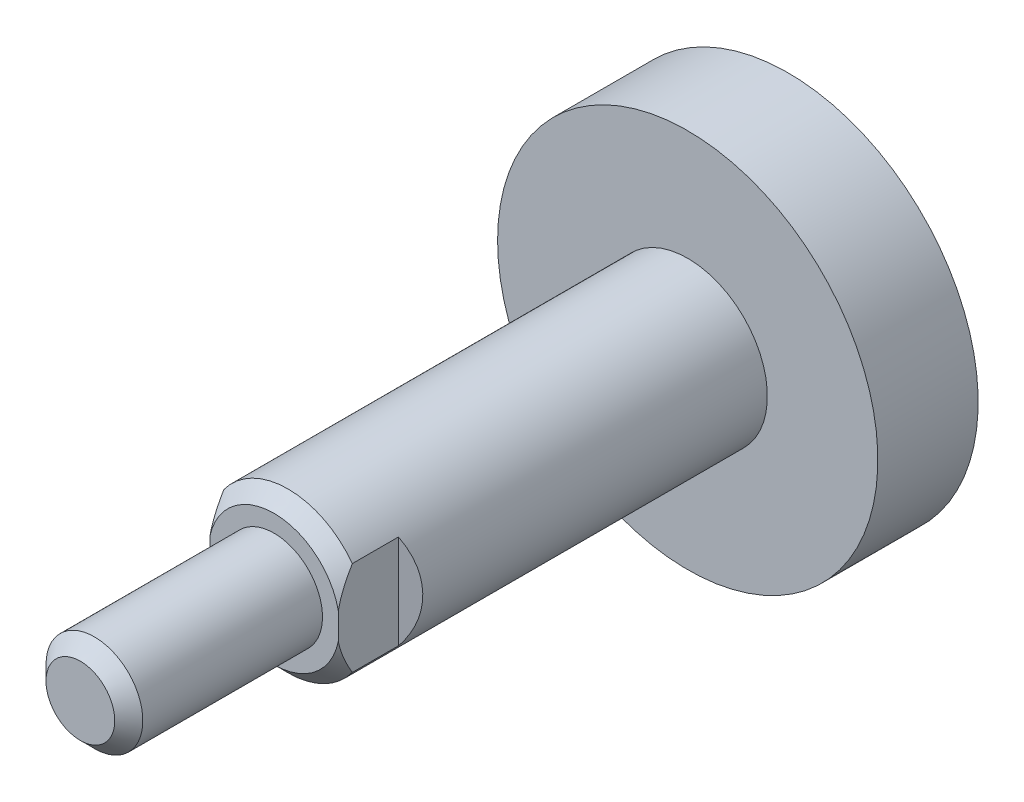
ISO-10303-21;
HEADER;
FILE_DESCRIPTION(('STEP AP214'),'2;1');
FILE_NAME('part.step','',(''),(''),'','','');
FILE_SCHEMA(('AUTOMOTIVE_DESIGN { 1 0 10303 214 1 1 1 1 }'));
ENDSEC;
DATA;
#1=APPLICATION_CONTEXT('core data for automotive mechanical design processes');
#2=APPLICATION_PROTOCOL_DEFINITION('international standard','automotive_design',2000,#1);
#3=PRODUCT_CONTEXT('',#1,'mechanical');
#4=PRODUCT('Part','Part','',(#3));
#5=PRODUCT_RELATED_PRODUCT_CATEGORY('part','',(#4));
#6=PRODUCT_DEFINITION_FORMATION('','',#4);
#7=PRODUCT_DEFINITION_CONTEXT('part definition',#1,'design');
#8=PRODUCT_DEFINITION('design','',#6,#7);
#9=PRODUCT_DEFINITION_SHAPE('','',#8);
#10=(LENGTH_UNIT() NAMED_UNIT(*) SI_UNIT(.MILLI.,.METRE.));
#11=(NAMED_UNIT(*) PLANE_ANGLE_UNIT() SI_UNIT($,.RADIAN.));
#12=(NAMED_UNIT(*) SI_UNIT($,.STERADIAN.) SOLID_ANGLE_UNIT());
#13=UNCERTAINTY_MEASURE_WITH_UNIT(LENGTH_MEASURE(1.E-05),#10,'distance_accuracy_value','');
#14=(GEOMETRIC_REPRESENTATION_CONTEXT(3) GLOBAL_UNCERTAINTY_ASSIGNED_CONTEXT((#13)) GLOBAL_UNIT_ASSIGNED_CONTEXT((#10,
#11,#12)) REPRESENTATION_CONTEXT('',''));
#15=CARTESIAN_POINT('',(0.,0.,0.));
#16=DIRECTION('',(0.,0.,1.));
#17=DIRECTION('',(1.,0.,0.));
#18=AXIS2_PLACEMENT_3D('',#15,#16,#17);
#19=CARTESIAN_POINT('',(0.,0.,35.266));
#20=DIRECTION('',(0.,0.,1.));
#21=DIRECTION('',(1.,0.,0.));
#22=AXIS2_PLACEMENT_3D('',#19,#20,#21);
#23=PLANE('',#22);
#24=CARTESIAN_POINT('',(0.,0.,35.2659999999219));
#25=DIRECTION('',(0.,0.,-1.));
#26=DIRECTION('',(-1.,0.,0.));
#27=AXIS2_PLACEMENT_3D('',#24,#25,#26);
#28=CIRCLE('',#27,1.71299999999519);
#29=CARTESIAN_POINT('',(-1.71299999999519,0.,35.2659999999219));
#30=VERTEX_POINT('',#29);
#31=EDGE_CURVE('E19',#30,#30,#28,.T.);
#32=ORIENTED_EDGE('',*,*,#31,.F.);
#33=EDGE_LOOP('',(#32));
#34=FACE_BOUND('',#33,.T.);
#35=ADVANCED_FACE('F16',(#34),#23,.T.);
#36=CARTESIAN_POINT('',(0.,0.,34.5659999999839));
#37=DIRECTION('',(0.,0.,-1.));
#38=DIRECTION('',(-1.,0.,0.));
#39=AXIS2_PLACEMENT_3D('',#36,#37,#38);
#40=CONICAL_SURFACE('',#39,2.41299999993316,0.785398163397448);
#41=ORIENTED_EDGE('',*,*,#31,.T.);
#42=EDGE_LOOP('',(#41));
#43=FACE_BOUND('',#42,.T.);
#44=CARTESIAN_POINT('',(0.,0.,34.566));
#45=DIRECTION('',(0.,0.,-1.));
#46=DIRECTION('',(-1.,0.,0.));
#47=AXIS2_PLACEMENT_3D('',#44,#45,#46);
#48=CIRCLE('',#47,2.413);
#49=CARTESIAN_POINT('',(-2.413,0.,34.566));
#50=VERTEX_POINT('',#49);
#51=EDGE_CURVE('E71',#50,#50,#48,.T.);
#52=ORIENTED_EDGE('',*,*,#51,.F.);
#53=EDGE_LOOP('',(#52));
#54=FACE_BOUND('',#53,.T.);
#55=ADVANCED_FACE('F196',(#43,#54),#40,.T.);
#56=CARTESIAN_POINT('',(0.,0.,35.266));
#57=DIRECTION('',(0.,0.,-1.));
#58=DIRECTION('',(-1.,0.,0.));
#59=AXIS2_PLACEMENT_3D('',#56,#57,#58);
#60=CYLINDRICAL_SURFACE('',#59,2.413);
#61=ORIENTED_EDGE('',*,*,#51,.T.);
#62=EDGE_LOOP('',(#61));
#63=FACE_BOUND('',#62,.T.);
#64=CARTESIAN_POINT('',(0.,0.,25.614));
#65=DIRECTION('',(0.,0.,-1.));
#66=DIRECTION('',(-1.,0.,0.));
#67=AXIS2_PLACEMENT_3D('',#64,#65,#66);
#68=CIRCLE('',#67,2.413);
#69=CARTESIAN_POINT('',(-2.413,0.,25.614));
#70=VERTEX_POINT('',#69);
#71=EDGE_CURVE('E70',#70,#70,#68,.F.);
#72=ORIENTED_EDGE('',*,*,#71,.T.);
#73=EDGE_LOOP('',(#72));
#74=FACE_BOUND('',#73,.T.);
#75=ADVANCED_FACE('F203',(#63,#74),#60,.T.);
#76=CARTESIAN_POINT('',(0.,0.,25.614));
#77=DIRECTION('',(0.,0.,-1.));
#78=DIRECTION('',(0.,1.,0.));
#79=AXIS2_PLACEMENT_3D('',#76,#77,#78);
#80=PLANE('',#79);
#81=ORIENTED_EDGE('',*,*,#71,.F.);
#82=EDGE_LOOP('',(#81));
#83=FACE_BOUND('',#82,.T.);
#84=DIRECTION('',(0.,1.,0.));
#85=VECTOR('',#84,1.);
#86=CARTESIAN_POINT('',(3.2,0.,25.614));
#87=LINE('',#86,#85);
#88=CARTESIAN_POINT('',(3.2,0.668102537170797,25.6139999999809));
#89=VERTEX_POINT('',#88);
#90=CARTESIAN_POINT('',(3.2,-0.668102537170798,25.6139999999809));
#91=VERTEX_POINT('',#90);
#92=EDGE_CURVE('E58',#89,#91,#87,.F.);
#93=ORIENTED_EDGE('',*,*,#92,.F.);
#94=CARTESIAN_POINT('',(0.,0.,25.6139999999618));
#95=DIRECTION('',(0.,0.,-1.));
#96=DIRECTION('',(0.,1.,0.));
#97=AXIS2_PLACEMENT_3D('',#94,#95,#96);
#98=CIRCLE('',#97,3.26900000004571);
#99=CARTESIAN_POINT('',(-3.2,0.668102537155263,25.6139999999841));
#100=VERTEX_POINT('',#99);
#101=EDGE_CURVE('E91',#100,#89,#98,.T.);
#102=ORIENTED_EDGE('',*,*,#101,.F.);
#103=DIRECTION('',(0.,1.,0.));
#104=VECTOR('',#103,1.);
#105=CARTESIAN_POINT('',(-3.2,-9.475,25.614));
#106=LINE('',#105,#104);
#107=CARTESIAN_POINT('',(-3.2,-0.668102537154732,25.6139999999842));
#108=VERTEX_POINT('',#107);
#109=EDGE_CURVE('E77',#100,#108,#106,.F.);
#110=ORIENTED_EDGE('',*,*,#109,.T.);
#111=CARTESIAN_POINT('',(0.,0.,25.6139999999618));
#112=DIRECTION('',(0.,0.,-1.));
#113=DIRECTION('',(0.,1.,0.));
#114=AXIS2_PLACEMENT_3D('',#111,#112,#113);
#115=CIRCLE('',#114,3.26900000004571);
#116=EDGE_CURVE('E75',#91,#108,#115,.T.);
#117=ORIENTED_EDGE('',*,*,#116,.F.);
#118=EDGE_LOOP('',(#93,#102,#110,#117));
#119=FACE_BOUND('',#118,.T.);
#120=ADVANCED_FACE('F76',(#83,#119),#80,.F.);
#121=CARTESIAN_POINT('',(0.,0.,24.9140000000807));
#122=DIRECTION('',(0.,0.,-1.));
#123=DIRECTION('',(0.,1.,0.));
#124=AXIS2_PLACEMENT_3D('',#121,#122,#123);
#125=CONICAL_SURFACE('',#124,3.96899999998368,0.785398163438051);
#126=CARTESIAN_POINT('',(-3.20000000000324,-0.668102537045559,25.6140000000079));
#127=CARTESIAN_POINT('',(-3.20000000000116,-0.791923989307162,25.5887118948215));
#128=CARTESIAN_POINT('',(-3.20000000000031,-0.914214432197644,25.5569533814339));
#129=CARTESIAN_POINT('',(-3.19999999999969,-1.15522323067472,25.482786734809));
#130=CARTESIAN_POINT('',(-3.19999999999992,-1.27394966585461,25.440405109426));
#131=CARTESIAN_POINT('',(-3.20000000000008,-1.50692397331803,25.3475394481742));
#132=CARTESIAN_POINT('',(-3.20000000000002,-1.62120166838874,25.2971285477279));
#133=CARTESIAN_POINT('',(-3.19999999999998,-1.8466563464418,25.1897204575799));
#134=CARTESIAN_POINT('',(-3.2,-1.95783200288132,25.1327205021669));
#135=CARTESIAN_POINT('',(-3.2,-2.1147772258552,25.047544782855));
#136=CARTESIAN_POINT('',(-3.2,-2.161701362435,25.021462011141));
#137=CARTESIAN_POINT('',(-3.2,-2.25515024754835,24.9683835316909));
#138=CARTESIAN_POINT('',(-3.2,-2.30167405357722,24.9413861634868));
#139=CARTESIAN_POINT('',(-3.2,-2.34796954838271,24.9140000000477));
#140=B_SPLINE_CURVE_WITH_KNOTS('',3,(#126,#127,#128,#129,#130,#131,#132,#133,#134,#135,#136,
#137,#138,#139),.UNSPECIFIED.,.F.,.F.,(4,2,2,2,2,2,4),(0.,0.378663318923574,0.756391005243895,
1.13085654278463,1.50547983437227,1.66653163363144,1.82789340191547),.UNSPECIFIED.);
#141=CARTESIAN_POINT('',(-3.2,-2.3479695483686,24.9140000000238));
#142=VERTEX_POINT('',#141);
#143=EDGE_CURVE('E116',#108,#142,#140,.T.);
#144=ORIENTED_EDGE('',*,*,#143,.T.);
#145=CARTESIAN_POINT('',(0.,0.,24.914));
#146=DIRECTION('',(0.,0.,-1.));
#147=DIRECTION('',(-1.,0.,0.));
#148=AXIS2_PLACEMENT_3D('',#145,#146,#147);
#149=CIRCLE('',#148,3.969);
#150=CARTESIAN_POINT('',(3.2,-2.3479695483686,24.9140000000238));
#151=VERTEX_POINT('',#150);
#152=EDGE_CURVE('E85',#151,#142,#149,.T.);
#153=ORIENTED_EDGE('',*,*,#152,.F.);
#154=CARTESIAN_POINT('',(3.2,-2.34796954838271,24.9140000000477));
#155=CARTESIAN_POINT('',(3.2,-2.28227540638902,24.9528576848915));
#156=CARTESIAN_POINT('',(3.2,-2.21612013329714,24.9909397042438));
#157=CARTESIAN_POINT('',(3.2,-2.08277615458881,25.065293160087));
#158=CARTESIAN_POINT('',(3.2,-2.01558715530726,25.1015640691656));
#159=CARTESIAN_POINT('',(3.2,-1.81330543751406,25.2067462963586));
#160=CARTESIAN_POINT('',(3.2,-1.6765834937986,25.2725768397312));
#161=CARTESIAN_POINT('',(3.2,-1.39788707534561,25.3932563066866));
#162=CARTESIAN_POINT('',(3.2,-1.25590184064602,25.4480810761872));
#163=CARTESIAN_POINT('',(3.2,-0.966123687795267,25.5431571719073));
#164=CARTESIAN_POINT('',(3.2,-0.81829778980787,25.5833066541209));
#165=CARTESIAN_POINT('',(3.2,-0.668102537044839,25.6140000000067));
#166=B_SPLINE_CURVE_WITH_KNOTS('',3,(#154,#155,#156,#157,#158,#159,#160,#161,#162,#163,#164,
#165),.UNSPECIFIED.,.F.,.F.,(4,2,2,2,2,4),(0.,0.228972156487963,0.458010607517393,
0.91289148643811,1.36876002116686,1.82773469580556),.UNSPECIFIED.);
#167=EDGE_CURVE('E63',#151,#91,#166,.T.);
#168=ORIENTED_EDGE('',*,*,#167,.T.);
#169=ORIENTED_EDGE('',*,*,#116,.T.);
#170=EDGE_LOOP('',(#144,#153,#168,#169));
#171=FACE_BOUND('',#170,.T.);
#172=ADVANCED_FACE('F84',(#171),#125,.T.);
#173=CARTESIAN_POINT('',(3.2,-9.475,22.614));
#174=DIRECTION('',(-0.500000000000005,0.,-0.866025403784436));
#175=DIRECTION('',(-0.866025403784436,0.,0.500000000000005));
#176=AXIS2_PLACEMENT_3D('',#173,#174,#175);
#177=PLANE('',#176);
#178=CARTESIAN_POINT('',(0.,0.,24.4615208614068));
#179=DIRECTION('',(-0.500000000000005,0.,-0.866025403784436));
#180=DIRECTION('',(0.866025403784436,0.,-0.500000000000005));
#181=AXIS2_PLACEMENT_3D('',#178,#179,#180);
#182=ELLIPSE('',#181,4.58300643682726,3.969);
#183=CARTESIAN_POINT('',(3.2,2.34796954835449,22.614));
#184=VERTEX_POINT('',#183);
#185=CARTESIAN_POINT('',(3.2,-2.34796954835449,22.614));
#186=VERTEX_POINT('',#185);
#187=EDGE_CURVE('E175',#184,#186,#182,.T.);
#188=ORIENTED_EDGE('',*,*,#187,.F.);
#189=DIRECTION('',(0.,1.,0.));
#190=VECTOR('',#189,1.);
#191=CARTESIAN_POINT('',(3.2,-9.475,22.614));
#192=LINE('',#191,#190);
#193=EDGE_CURVE('E86',#184,#186,#192,.F.);
#194=ORIENTED_EDGE('',*,*,#193,.T.);
#195=EDGE_LOOP('',(#188,#194));
#196=FACE_BOUND('',#195,.T.);
#197=ADVANCED_FACE('F111',(#196),#177,.F.);
#198=CARTESIAN_POINT('',(-3.2,-9.475,22.614));
#199=DIRECTION('',(0.500000000000004,0.,-0.866025403784436));
#200=DIRECTION('',(-0.866025403784436,0.,-0.500000000000004));
#201=AXIS2_PLACEMENT_3D('',#198,#199,#200);
#202=PLANE('',#201);
#203=CARTESIAN_POINT('',(0.,0.,24.4615208614068));
#204=DIRECTION('',(0.500000000000004,0.,-0.866025403784436));
#205=DIRECTION('',(-0.866025403784436,0.,-0.500000000000004));
#206=AXIS2_PLACEMENT_3D('',#203,#204,#205);
#207=ELLIPSE('',#206,4.58300643682726,3.969);
#208=CARTESIAN_POINT('',(-3.2,-2.34796954835449,22.614));
#209=VERTEX_POINT('',#208);
#210=CARTESIAN_POINT('',(-3.2,2.34796954835449,22.614));
#211=VERTEX_POINT('',#210);
#212=EDGE_CURVE('E172',#209,#211,#207,.T.);
#213=ORIENTED_EDGE('',*,*,#212,.F.);
#214=DIRECTION('',(0.,1.,0.));
#215=VECTOR('',#214,1.);
#216=CARTESIAN_POINT('',(-3.2,-9.475,22.614));
#217=LINE('',#216,#215);
#218=EDGE_CURVE('E81',#209,#211,#217,.T.);
#219=ORIENTED_EDGE('',*,*,#218,.T.);
#220=EDGE_LOOP('',(#213,#219));
#221=FACE_BOUND('',#220,.T.);
#222=ADVANCED_FACE('F129',(#221),#202,.F.);
#223=CARTESIAN_POINT('',(-3.2,-9.475,25.614));
#224=DIRECTION('',(1.,0.,0.));
#225=DIRECTION('',(0.,0.,-1.));
#226=AXIS2_PLACEMENT_3D('',#223,#224,#225);
#227=PLANE('',#226);
#228=ORIENTED_EDGE('',*,*,#143,.F.);
#229=ORIENTED_EDGE('',*,*,#109,.F.);
#230=CARTESIAN_POINT('',(-3.19999999998987,2.34796954838807,24.9140000000384));
#231=CARTESIAN_POINT('',(-3.19999999999627,2.28227540639574,24.9528576848853));
#232=CARTESIAN_POINT('',(-3.19999999999898,2.21612013330425,24.9909397042391));
#233=CARTESIAN_POINT('',(-3.20000000000102,2.08277615459583,25.0652931600838));
#234=CARTESIAN_POINT('',(-3.20000000000036,2.01558715531381,25.1015640691624));
#235=CARTESIAN_POINT('',(-3.19999999999929,1.81330543751945,25.2067462963555));
#236=CARTESIAN_POINT('',(-3.1999999999998,1.67658349380355,25.2725768397288));
#237=CARTESIAN_POINT('',(-3.2000000000002,1.39788707534955,25.3932563066852));
#238=CARTESIAN_POINT('',(-3.2000000000001,1.2559018406494,25.4480810761861));
#239=CARTESIAN_POINT('',(-3.1999999999999,0.966123687797418,25.5431571719066));
#240=CARTESIAN_POINT('',(-3.19999999999979,0.818297789809342,25.5833066541205));
#241=CARTESIAN_POINT('',(-3.2,0.668102537045687,25.6140000000065));
#242=B_SPLINE_CURVE_WITH_KNOTS('',3,(#230,#231,#232,#233,#234,#235,#236,#237,#238,#239,#240,
#241),.UNSPECIFIED.,.F.,.F.,(4,2,2,2,2,4),(0.,0.228972156489184,0.458010607519769,
0.912891486442607,1.3687600211732,1.82773469581398),.UNSPECIFIED.);
#243=CARTESIAN_POINT('',(-3.2,2.34796954835449,24.9140000000322));
#244=VERTEX_POINT('',#243);
#245=EDGE_CURVE('E121',#244,#100,#242,.T.);
#246=ORIENTED_EDGE('',*,*,#245,.F.);
#247=DIRECTION('',(0.,0.,-1.));
#248=VECTOR('',#247,1.);
#249=CARTESIAN_POINT('',(-3.2,2.34796954835449,36.8400272581176));
#250=LINE('',#249,#248);
#251=EDGE_CURVE('E174',#211,#244,#250,.F.);
#252=ORIENTED_EDGE('',*,*,#251,.F.);
#253=ORIENTED_EDGE('',*,*,#218,.F.);
#254=DIRECTION('',(0.,0.,-1.));
#255=VECTOR('',#254,1.);
#256=CARTESIAN_POINT('',(-3.2,-2.34796954835449,36.8400272581176));
#257=LINE('',#256,#255);
#258=EDGE_CURVE('E177',#142,#209,#257,.T.);
#259=ORIENTED_EDGE('',*,*,#258,.F.);
#260=EDGE_LOOP('',(#228,#229,#246,#252,#253,#259));
#261=FACE_BOUND('',#260,.T.);
#262=ADVANCED_FACE('F125',(#261),#227,.F.);
#263=CARTESIAN_POINT('',(0.,0.,24.9140000000807));
#264=DIRECTION('',(0.,0.,-1.));
#265=DIRECTION('',(0.,1.,0.));
#266=AXIS2_PLACEMENT_3D('',#263,#264,#265);
#267=CONICAL_SURFACE('',#266,3.96899999998368,0.785398163438051);
#268=ORIENTED_EDGE('',*,*,#245,.T.);
#269=ORIENTED_EDGE('',*,*,#101,.T.);
#270=CARTESIAN_POINT('',(3.20000000000325,0.668102537045564,25.6140000000079));
#271=CARTESIAN_POINT('',(3.20000000000117,0.791923989307168,25.5887118948215));
#272=CARTESIAN_POINT('',(3.20000000000031,0.914214432197651,25.5569533814339));
#273=CARTESIAN_POINT('',(3.19999999999969,1.15522323067473,25.482786734809));
#274=CARTESIAN_POINT('',(3.19999999999992,1.27394966585462,25.440405109426));
#275=CARTESIAN_POINT('',(3.20000000000008,1.50692397331804,25.3475394481742));
#276=CARTESIAN_POINT('',(3.20000000000003,1.62120166838875,25.2971285477279));
#277=CARTESIAN_POINT('',(3.19999999999998,1.84665634644181,25.1897204575799));
#278=CARTESIAN_POINT('',(3.2,1.95783200288133,25.1327205021669));
#279=CARTESIAN_POINT('',(3.20000000000001,2.11477722585521,25.0475447828549));
#280=CARTESIAN_POINT('',(3.2,2.161701362435,25.021462011141));
#281=CARTESIAN_POINT('',(3.2,2.25515024754835,24.9683835316909));
#282=CARTESIAN_POINT('',(3.2,2.30167405357722,24.9413861634868));
#283=CARTESIAN_POINT('',(3.2,2.34796954838271,24.9140000000477));
#284=B_SPLINE_CURVE_WITH_KNOTS('',3,(#270,#271,#272,#273,#274,#275,#276,#277,#278,#279,#280,
#281,#282,#283),.UNSPECIFIED.,.F.,.F.,(4,2,2,2,2,2,4),(0.,0.378663318923575,0.756391005243901,
1.13085654278463,1.50547983437227,1.66653163363144,1.82789340191546),.UNSPECIFIED.);
#285=CARTESIAN_POINT('',(3.2,2.3479695483686,24.9140000000238));
#286=VERTEX_POINT('',#285);
#287=EDGE_CURVE('E66',#89,#286,#284,.T.);
#288=ORIENTED_EDGE('',*,*,#287,.T.);
#289=CARTESIAN_POINT('',(0.,0.,24.914));
#290=DIRECTION('',(0.,0.,-1.));
#291=DIRECTION('',(-1.,0.,0.));
#292=AXIS2_PLACEMENT_3D('',#289,#290,#291);
#293=CIRCLE('',#292,3.969);
#294=EDGE_CURVE('E34',#244,#286,#293,.T.);
#295=ORIENTED_EDGE('',*,*,#294,.F.);
#296=EDGE_LOOP('',(#268,#269,#288,#295));
#297=FACE_BOUND('',#296,.T.);
#298=ADVANCED_FACE('F128',(#297),#267,.T.);
#299=CARTESIAN_POINT('',(3.2,-9.475,25.614));
#300=DIRECTION('',(-1.,0.,0.));
#301=DIRECTION('',(0.,0.,1.));
#302=AXIS2_PLACEMENT_3D('',#299,#300,#301);
#303=PLANE('',#302);
#304=ORIENTED_EDGE('',*,*,#287,.F.);
#305=ORIENTED_EDGE('',*,*,#92,.T.);
#306=ORIENTED_EDGE('',*,*,#167,.F.);
#307=DIRECTION('',(0.,0.,-1.));
#308=VECTOR('',#307,1.);
#309=CARTESIAN_POINT('',(3.20000000000001,-2.34796954835449,36.8400272581176));
#310=LINE('',#309,#308);
#311=EDGE_CURVE('E88',#186,#151,#310,.F.);
#312=ORIENTED_EDGE('',*,*,#311,.F.);
#313=ORIENTED_EDGE('',*,*,#193,.F.);
#314=DIRECTION('',(0.,0.,-1.));
#315=VECTOR('',#314,1.);
#316=CARTESIAN_POINT('',(3.2,2.34796954835449,36.8400272581176));
#317=LINE('',#316,#315);
#318=EDGE_CURVE('E166',#286,#184,#317,.T.);
#319=ORIENTED_EDGE('',*,*,#318,.F.);
#320=EDGE_LOOP('',(#304,#305,#306,#312,#313,#319));
#321=FACE_BOUND('',#320,.T.);
#322=ADVANCED_FACE('F60',(#321),#303,.F.);
#323=CARTESIAN_POINT('',(0.,0.,36.8400272581176));
#324=DIRECTION('',(0.,0.,-1.));
#325=DIRECTION('',(-1.,0.,0.));
#326=AXIS2_PLACEMENT_3D('',#323,#324,#325);
#327=CYLINDRICAL_SURFACE('',#326,3.969);
#328=CARTESIAN_POINT('',(0.,0.,5.));
#329=DIRECTION('',(0.,0.,-1.));
#330=DIRECTION('',(-1.,0.,0.));
#331=AXIS2_PLACEMENT_3D('',#328,#329,#330);
#332=CIRCLE('',#331,3.969);
#333=CARTESIAN_POINT('',(-3.969,0.,5.));
#334=VERTEX_POINT('',#333);
#335=EDGE_CURVE('E164',#334,#334,#332,.T.);
#336=ORIENTED_EDGE('',*,*,#335,.F.);
#337=EDGE_LOOP('',(#336));
#338=FACE_BOUND('',#337,.T.);
#339=ORIENTED_EDGE('',*,*,#294,.T.);
#340=ORIENTED_EDGE('',*,*,#318,.T.);
#341=ORIENTED_EDGE('',*,*,#187,.T.);
#342=ORIENTED_EDGE('',*,*,#311,.T.);
#343=ORIENTED_EDGE('',*,*,#152,.T.);
#344=ORIENTED_EDGE('',*,*,#258,.T.);
#345=ORIENTED_EDGE('',*,*,#212,.T.);
#346=ORIENTED_EDGE('',*,*,#251,.T.);
#347=EDGE_LOOP('',(#339,#340,#341,#342,#343,#344,#345,#346));
#348=FACE_BOUND('',#347,.T.);
#349=ADVANCED_FACE('F155',(#338,#348),#327,.T.);
#350=CARTESIAN_POINT('',(0.,0.,5.));
#351=DIRECTION('',(0.,0.,1.));
#352=DIRECTION('',(1.,0.,0.));
#353=AXIS2_PLACEMENT_3D('',#350,#351,#352);
#354=PLANE('',#353);
#355=CARTESIAN_POINT('',(0.,0.,5.));
#356=DIRECTION('',(0.,0.,-1.));
#357=DIRECTION('',(-1.,0.,0.));
#358=AXIS2_PLACEMENT_3D('',#355,#356,#357);
#359=CIRCLE('',#358,9.475);
#360=CARTESIAN_POINT('',(-9.475,0.,5.));
#361=VERTEX_POINT('',#360);
#362=EDGE_CURVE('E25',#361,#361,#359,.T.);
#363=ORIENTED_EDGE('',*,*,#362,.F.);
#364=EDGE_LOOP('',(#363));
#365=FACE_BOUND('',#364,.T.);
#366=ORIENTED_EDGE('',*,*,#335,.T.);
#367=EDGE_LOOP('',(#366));
#368=FACE_BOUND('',#367,.T.);
#369=ADVANCED_FACE('F149',(#365,#368),#354,.T.);
#370=CARTESIAN_POINT('',(0.,0.,5.));
#371=DIRECTION('',(0.,0.,-1.));
#372=DIRECTION('',(-1.,0.,0.));
#373=AXIS2_PLACEMENT_3D('',#370,#371,#372);
#374=CYLINDRICAL_SURFACE('',#373,9.475);
#375=ORIENTED_EDGE('',*,*,#362,.T.);
#376=EDGE_LOOP('',(#375));
#377=FACE_BOUND('',#376,.T.);
#378=CARTESIAN_POINT('',(0.,0.,0.));
#379=DIRECTION('',(0.,0.,-1.));
#380=DIRECTION('',(-1.,0.,0.));
#381=AXIS2_PLACEMENT_3D('',#378,#379,#380);
#382=CIRCLE('',#381,9.475);
#383=CARTESIAN_POINT('',(-9.475,0.,0.));
#384=VERTEX_POINT('',#383);
#385=EDGE_CURVE('E11',#384,#384,#382,.F.);
#386=ORIENTED_EDGE('',*,*,#385,.T.);
#387=EDGE_LOOP('',(#386));
#388=FACE_BOUND('',#387,.T.);
#389=ADVANCED_FACE('F143',(#377,#388),#374,.T.);
#390=CARTESIAN_POINT('',(0.,0.,0.));
#391=DIRECTION('',(0.,0.,1.));
#392=DIRECTION('',(1.,0.,0.));
#393=AXIS2_PLACEMENT_3D('',#390,#391,#392);
#394=PLANE('',#393);
#395=ORIENTED_EDGE('',*,*,#385,.F.);
#396=EDGE_LOOP('',(#395));
#397=FACE_BOUND('',#396,.T.);
#398=ADVANCED_FACE('F141',(#397),#394,.F.);
#399=CLOSED_SHELL('',(#35,#55,#75,#120,#172,#197,#222,#262,#298,#322,#349,#369,#389,#398));
#400=MANIFOLD_SOLID_BREP('B1',#399);
#401=ADVANCED_BREP_SHAPE_REPRESENTATION('',(#18,#400),#14);
#402=SHAPE_DEFINITION_REPRESENTATION(#9,#401);
ENDSEC;
END-ISO-10303-21;
